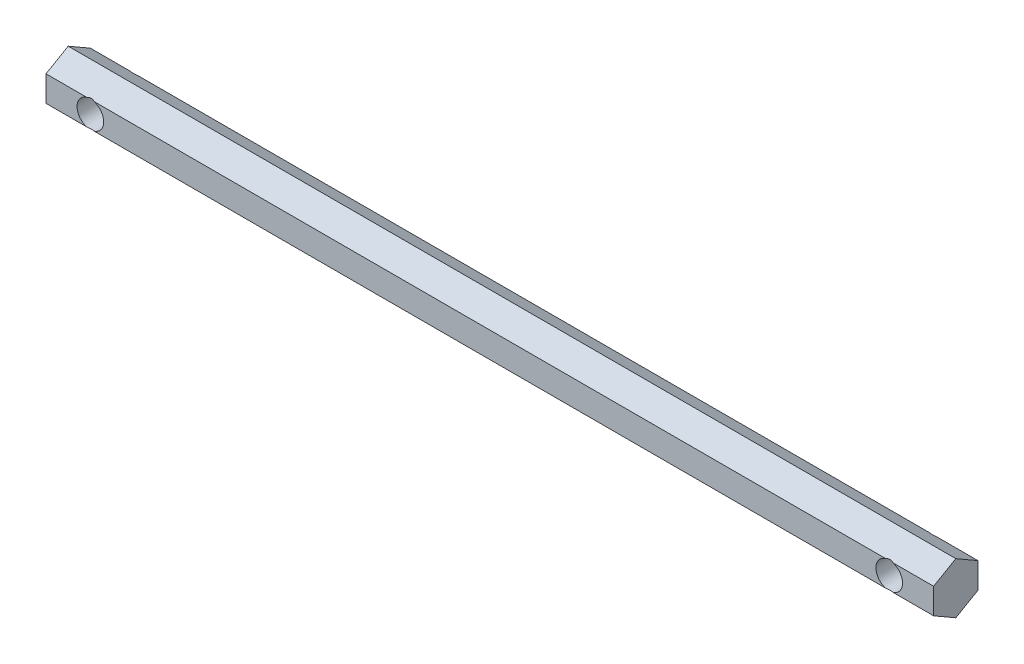
ISO-10303-21;
HEADER;
FILE_DESCRIPTION(('STEP AP214'),'2;1');
FILE_NAME('part.step','',(''),(''),'','','');
FILE_SCHEMA(('AUTOMOTIVE_DESIGN { 1 0 10303 214 1 1 1 1 }'));
ENDSEC;
DATA;
#1=APPLICATION_CONTEXT('core data for automotive mechanical design processes');
#2=APPLICATION_PROTOCOL_DEFINITION('international standard','automotive_design',2000,#1);
#3=PRODUCT_CONTEXT('',#1,'mechanical');
#4=PRODUCT('Part','Part','',(#3));
#5=PRODUCT_RELATED_PRODUCT_CATEGORY('part','',(#4));
#6=PRODUCT_DEFINITION_FORMATION('','',#4);
#7=PRODUCT_DEFINITION_CONTEXT('part definition',#1,'design');
#8=PRODUCT_DEFINITION('design','',#6,#7);
#9=PRODUCT_DEFINITION_SHAPE('','',#8);
#10=(LENGTH_UNIT() NAMED_UNIT(*) SI_UNIT(.MILLI.,.METRE.));
#11=(NAMED_UNIT(*) PLANE_ANGLE_UNIT() SI_UNIT($,.RADIAN.));
#12=(NAMED_UNIT(*) SI_UNIT($,.STERADIAN.) SOLID_ANGLE_UNIT());
#13=UNCERTAINTY_MEASURE_WITH_UNIT(LENGTH_MEASURE(1.E-05),#10,'distance_accuracy_value','');
#14=(GEOMETRIC_REPRESENTATION_CONTEXT(3) GLOBAL_UNCERTAINTY_ASSIGNED_CONTEXT((#13)) GLOBAL_UNIT_ASSIGNED_CONTEXT((#10,
#11,#12)) REPRESENTATION_CONTEXT('',''));
#15=CARTESIAN_POINT('',(0.,0.,0.));
#16=DIRECTION('',(0.,0.,1.));
#17=DIRECTION('',(1.,0.,0.));
#18=AXIS2_PLACEMENT_3D('',#15,#16,#17);
#19=CARTESIAN_POINT('',(100.,2.88675134594811,5.));
#20=DIRECTION('',(0.,0.,-1.));
#21=DIRECTION('',(0.,1.,0.));
#22=AXIS2_PLACEMENT_3D('',#19,#20,#21);
#23=PLANE('',#22);
#24=DIRECTION('',(-1.,0.,0.));
#25=VECTOR('',#24,1.);
#26=CARTESIAN_POINT('',(100.,2.88675134594811,5.));
#27=LINE('',#26,#25);
#28=CARTESIAN_POINT('',(100.,2.88675134594811,5.));
#29=VERTEX_POINT('',#28);
#30=CARTESIAN_POINT('',(90.8164965809278,2.88675134594811,5.));
#31=VERTEX_POINT('',#30);
#32=EDGE_CURVE('E182',#29,#31,#27,.T.);
#33=ORIENTED_EDGE('',*,*,#32,.T.);
#34=CARTESIAN_POINT('',(90.,0.,5.));
#35=DIRECTION('',(0.,0.,1.));
#36=DIRECTION('',(1.,0.,0.));
#37=AXIS2_PLACEMENT_3D('',#34,#35,#36);
#38=CIRCLE('',#37,3.00000000000001);
#39=CARTESIAN_POINT('',(90.8164965809277,-2.88675134594814,5.));
#40=VERTEX_POINT('',#39);
#41=EDGE_CURVE('E265',#40,#31,#38,.T.);
#42=ORIENTED_EDGE('',*,*,#41,.F.);
#43=DIRECTION('',(-1.,0.,0.));
#44=VECTOR('',#43,1.);
#45=CARTESIAN_POINT('',(100.,-2.88675134594815,4.99999999999998));
#46=LINE('',#45,#44);
#47=CARTESIAN_POINT('',(100.,-2.88675134594815,4.99999999999998));
#48=VERTEX_POINT('',#47);
#49=EDGE_CURVE('E177',#48,#40,#46,.T.);
#50=ORIENTED_EDGE('',*,*,#49,.F.);
#51=DIRECTION('',(0.,-1.,0.));
#52=VECTOR('',#51,1.);
#53=CARTESIAN_POINT('',(100.,2.88675134594811,5.));
#54=LINE('',#53,#52);
#55=EDGE_CURVE('E215',#29,#48,#54,.T.);
#56=ORIENTED_EDGE('',*,*,#55,.F.);
#57=EDGE_LOOP('',(#33,#42,#50,#56));
#58=FACE_BOUND('',#57,.T.);
#59=ADVANCED_FACE('F37',(#58),#23,.F.);
#60=CARTESIAN_POINT('',(89.1835034190723,-2.88675134594815,4.99999999999998));
#61=VERTEX_POINT('',#60);
#62=CARTESIAN_POINT('',(-89.1835034190722,-2.88675134594814,5.));
#63=VERTEX_POINT('',#62);
#64=EDGE_CURVE('E181',#61,#63,#46,.T.);
#65=ORIENTED_EDGE('',*,*,#64,.F.);
#66=CARTESIAN_POINT('',(89.1835034190722,2.88675134594811,5.));
#67=VERTEX_POINT('',#66);
#68=EDGE_CURVE('E60',#67,#61,#38,.T.);
#69=ORIENTED_EDGE('',*,*,#68,.F.);
#70=CARTESIAN_POINT('',(-89.1835034190723,2.88675134594811,5.));
#71=VERTEX_POINT('',#70);
#72=EDGE_CURVE('E186',#67,#71,#27,.T.);
#73=ORIENTED_EDGE('',*,*,#72,.T.);
#74=CARTESIAN_POINT('',(-90.,0.,5.));
#75=DIRECTION('',(0.,0.,1.));
#76=DIRECTION('',(1.,0.,0.));
#77=AXIS2_PLACEMENT_3D('',#74,#75,#76);
#78=CIRCLE('',#77,3.00000000000001);
#79=EDGE_CURVE('E272',#63,#71,#78,.T.);
#80=ORIENTED_EDGE('',*,*,#79,.F.);
#81=EDGE_LOOP('',(#65,#69,#73,#80));
#82=FACE_BOUND('',#81,.T.);
#83=ADVANCED_FACE('F271',(#82),#23,.F.);
#84=CARTESIAN_POINT('',(100.,-2.88675134594808,-5.00000000000002));
#85=DIRECTION('',(0.,0.,1.));
#86=DIRECTION('',(0.,-1.,0.));
#87=AXIS2_PLACEMENT_3D('',#84,#85,#86);
#88=PLANE('',#87);
#89=DIRECTION('',(-1.,0.,0.));
#90=VECTOR('',#89,1.);
#91=CARTESIAN_POINT('',(100.,-2.88675134594808,-5.00000000000002));
#92=LINE('',#91,#90);
#93=CARTESIAN_POINT('',(100.,-2.88675134594808,-5.00000000000002));
#94=VERTEX_POINT('',#93);
#95=CARTESIAN_POINT('',(90.8164965809279,-2.88675134594808,-5.00000000000002));
#96=VERTEX_POINT('',#95);
#97=EDGE_CURVE('E170',#94,#96,#92,.T.);
#98=ORIENTED_EDGE('',*,*,#97,.T.);
#99=CARTESIAN_POINT('',(90.,0.,-4.99999999999999));
#100=DIRECTION('',(0.,0.,1.));
#101=DIRECTION('',(0.,-1.,0.));
#102=AXIS2_PLACEMENT_3D('',#99,#100,#101);
#103=CIRCLE('',#102,3.00000000000001);
#104=CARTESIAN_POINT('',(90.8164965809275,2.88675134594818,-5.00000000000002));
#105=VERTEX_POINT('',#104);
#106=EDGE_CURVE('E11',#96,#105,#103,.T.);
#107=ORIENTED_EDGE('',*,*,#106,.T.);
#108=DIRECTION('',(-1.,0.,0.));
#109=VECTOR('',#108,1.);
#110=CARTESIAN_POINT('',(100.,2.88675134594818,-4.99999999999996));
#111=LINE('',#110,#109);
#112=CARTESIAN_POINT('',(100.,2.88675134594818,-4.99999999999996));
#113=VERTEX_POINT('',#112);
#114=EDGE_CURVE('E161',#113,#105,#111,.T.);
#115=ORIENTED_EDGE('',*,*,#114,.F.);
#116=DIRECTION('',(0.,1.,0.));
#117=VECTOR('',#116,1.);
#118=CARTESIAN_POINT('',(100.,-2.88675134594808,-5.00000000000002));
#119=LINE('',#118,#117);
#120=EDGE_CURVE('E165',#94,#113,#119,.T.);
#121=ORIENTED_EDGE('',*,*,#120,.F.);
#122=EDGE_LOOP('',(#98,#107,#115,#121));
#123=FACE_BOUND('',#122,.T.);
#124=ADVANCED_FACE('F249',(#123),#88,.F.);
#125=CARTESIAN_POINT('',(89.1835034190724,2.88675134594818,-5.00000000000002));
#126=VERTEX_POINT('',#125);
#127=CARTESIAN_POINT('',(-89.1835034190725,2.88675134594818,-5.00000000000002));
#128=VERTEX_POINT('',#127);
#129=EDGE_CURVE('E155',#126,#128,#111,.T.);
#130=ORIENTED_EDGE('',*,*,#129,.F.);
#131=CARTESIAN_POINT('',(89.1835034190721,-2.88675134594808,-5.00000000000002));
#132=VERTEX_POINT('',#131);
#133=EDGE_CURVE('E41',#126,#132,#103,.T.);
#134=ORIENTED_EDGE('',*,*,#133,.T.);
#135=CARTESIAN_POINT('',(-89.183503419072,-2.88675134594808,-5.00000000000002));
#136=VERTEX_POINT('',#135);
#137=EDGE_CURVE('E157',#132,#136,#92,.T.);
#138=ORIENTED_EDGE('',*,*,#137,.T.);
#139=CARTESIAN_POINT('',(-90.,0.,-4.99999999999999));
#140=DIRECTION('',(0.,0.,1.));
#141=DIRECTION('',(0.,-1.,0.));
#142=AXIS2_PLACEMENT_3D('',#139,#140,#141);
#143=CIRCLE('',#142,3.00000000000001);
#144=EDGE_CURVE('E140',#136,#128,#143,.T.);
#145=ORIENTED_EDGE('',*,*,#144,.T.);
#146=EDGE_LOOP('',(#130,#134,#138,#145));
#147=FACE_BOUND('',#146,.T.);
#148=ADVANCED_FACE('F153',(#147),#88,.F.);
#149=CARTESIAN_POINT('',(100.,2.88675134594818,-4.99999999999996));
#150=DIRECTION('',(0.,-0.866025403784442,0.499999999999995));
#151=DIRECTION('',(0.,-0.499999999999995,-0.866025403784442));
#152=AXIS2_PLACEMENT_3D('',#149,#150,#151);
#153=PLANE('',#152);
#154=ORIENTED_EDGE('',*,*,#114,.T.);
#155=CARTESIAN_POINT('',(90.,0.,-10.0000000000001));
#156=DIRECTION('',(0.,-0.866025403784442,0.499999999999995));
#157=DIRECTION('',(0.,0.499999999999995,0.866025403784442));
#158=AXIS2_PLACEMENT_3D('',#155,#156,#157);
#159=ELLIPSE('',#158,6.00000000000008,3.00000000000001);
#160=EDGE_CURVE('E160',#105,#126,#159,.T.);
#161=ORIENTED_EDGE('',*,*,#160,.T.);
#162=ORIENTED_EDGE('',*,*,#129,.T.);
#163=CARTESIAN_POINT('',(-90.,0.,-10.0000000000002));
#164=DIRECTION('',(0.,-0.866025403784442,0.499999999999995));
#165=DIRECTION('',(0.,0.499999999999995,0.866025403784442));
#166=AXIS2_PLACEMENT_3D('',#163,#164,#165);
#167=ELLIPSE('',#166,6.00000000000008,3.00000000000001);
#168=CARTESIAN_POINT('',(-90.8164965809274,2.88675134594818,-5.00000000000002));
#169=VERTEX_POINT('',#168);
#170=EDGE_CURVE('E137',#128,#169,#167,.T.);
#171=ORIENTED_EDGE('',*,*,#170,.T.);
#172=CARTESIAN_POINT('',(-100.,2.88675134594818,-4.99999999999996));
#173=VERTEX_POINT('',#172);
#174=EDGE_CURVE('E162',#169,#173,#111,.T.);
#175=ORIENTED_EDGE('',*,*,#174,.T.);
#176=DIRECTION('',(0.,0.499999999999995,0.866025403784441));
#177=VECTOR('',#176,1.);
#178=CARTESIAN_POINT('',(-100.,2.88675134594818,-4.99999999999996));
#179=LINE('',#178,#177);
#180=CARTESIAN_POINT('',(-100.,5.77350269189625,0.));
#181=VERTEX_POINT('',#180);
#182=EDGE_CURVE('E207',#173,#181,#179,.T.);
#183=ORIENTED_EDGE('',*,*,#182,.T.);
#184=DIRECTION('',(-1.,0.,0.));
#185=VECTOR('',#184,1.);
#186=CARTESIAN_POINT('',(100.,5.77350269189625,0.));
#187=LINE('',#186,#185);
#188=CARTESIAN_POINT('',(100.,5.77350269189625,0.));
#189=VERTEX_POINT('',#188);
#190=EDGE_CURVE('E185',#189,#181,#187,.T.);
#191=ORIENTED_EDGE('',*,*,#190,.F.);
#192=DIRECTION('',(0.,0.499999999999995,0.866025403784441));
#193=VECTOR('',#192,1.);
#194=CARTESIAN_POINT('',(100.,2.88675134594818,-4.99999999999996));
#195=LINE('',#194,#193);
#196=EDGE_CURVE('E208',#113,#189,#195,.T.);
#197=ORIENTED_EDGE('',*,*,#196,.F.);
#198=EDGE_LOOP('',(#154,#161,#162,#171,#175,#183,#191,#197));
#199=FACE_BOUND('',#198,.T.);
#200=ADVANCED_FACE('F39',(#199),#153,.F.);
#201=CARTESIAN_POINT('',(100.,5.77350269189625,0.));
#202=DIRECTION('',(0.,-0.866025403784438,-0.500000000000001));
#203=DIRECTION('',(0.,0.500000000000001,-0.866025403784438));
#204=AXIS2_PLACEMENT_3D('',#201,#202,#203);
#205=PLANE('',#204);
#206=ORIENTED_EDGE('',*,*,#72,.F.);
#207=CARTESIAN_POINT('',(90.,0.,9.99999999999997));
#208=DIRECTION('',(0.,-0.866025403784438,-0.500000000000001));
#209=DIRECTION('',(0.,-0.500000000000001,0.866025403784438));
#210=AXIS2_PLACEMENT_3D('',#207,#208,#209);
#211=ELLIPSE('',#210,6.,3.00000000000001);
#212=EDGE_CURVE('E256',#67,#31,#211,.T.);
#213=ORIENTED_EDGE('',*,*,#212,.T.);
#214=ORIENTED_EDGE('',*,*,#32,.F.);
#215=DIRECTION('',(0.,-0.500000000000001,0.866025403784438));
#216=VECTOR('',#215,1.);
#217=CARTESIAN_POINT('',(100.,5.77350269189625,0.));
#218=LINE('',#217,#216);
#219=EDGE_CURVE('E210',#189,#29,#218,.T.);
#220=ORIENTED_EDGE('',*,*,#219,.F.);
#221=ORIENTED_EDGE('',*,*,#190,.T.);
#222=DIRECTION('',(0.,-0.500000000000001,0.866025403784438));
#223=VECTOR('',#222,1.);
#224=CARTESIAN_POINT('',(-100.,5.77350269189625,0.));
#225=LINE('',#224,#223);
#226=CARTESIAN_POINT('',(-100.,2.88675134594811,5.));
#227=VERTEX_POINT('',#226);
#228=EDGE_CURVE('E227',#181,#227,#225,.T.);
#229=ORIENTED_EDGE('',*,*,#228,.T.);
#230=CARTESIAN_POINT('',(-90.8164965809277,2.88675134594811,5.));
#231=VERTEX_POINT('',#230);
#232=EDGE_CURVE('E180',#231,#227,#27,.T.);
#233=ORIENTED_EDGE('',*,*,#232,.F.);
#234=CARTESIAN_POINT('',(-90.,0.,10.));
#235=DIRECTION('',(0.,-0.866025403784438,-0.500000000000001));
#236=DIRECTION('',(0.,-0.500000000000001,0.866025403784438));
#237=AXIS2_PLACEMENT_3D('',#234,#235,#236);
#238=ELLIPSE('',#237,6.,3.00000000000001);
#239=EDGE_CURVE('E148',#231,#71,#238,.T.);
#240=ORIENTED_EDGE('',*,*,#239,.T.);
#241=EDGE_LOOP('',(#206,#213,#214,#220,#221,#229,#233,#240));
#242=FACE_BOUND('',#241,.T.);
#243=ADVANCED_FACE('F244',(#242),#205,.F.);
#244=CARTESIAN_POINT('',(-90.8164965809278,-2.88675134594815,4.99999999999998));
#245=VERTEX_POINT('',#244);
#246=CARTESIAN_POINT('',(-100.,-2.88675134594815,4.99999999999998));
#247=VERTEX_POINT('',#246);
#248=EDGE_CURVE('E176',#245,#247,#46,.T.);
#249=ORIENTED_EDGE('',*,*,#248,.F.);
#250=EDGE_CURVE('E52',#231,#245,#78,.T.);
#251=ORIENTED_EDGE('',*,*,#250,.F.);
#252=ORIENTED_EDGE('',*,*,#232,.T.);
#253=DIRECTION('',(0.,-1.,0.));
#254=VECTOR('',#253,1.);
#255=CARTESIAN_POINT('',(-100.,2.88675134594811,5.));
#256=LINE('',#255,#254);
#257=EDGE_CURVE('E230',#227,#247,#256,.T.);
#258=ORIENTED_EDGE('',*,*,#257,.T.);
#259=EDGE_LOOP('',(#249,#251,#252,#258));
#260=FACE_BOUND('',#259,.T.);
#261=ADVANCED_FACE('F239',(#260),#23,.F.);
#262=CARTESIAN_POINT('',(100.,-2.88675134594815,4.99999999999998));
#263=DIRECTION('',(0.,0.866025403784442,-0.499999999999995));
#264=DIRECTION('',(0.,0.499999999999995,0.866025403784442));
#265=AXIS2_PLACEMENT_3D('',#262,#263,#264);
#266=PLANE('',#265);
#267=ORIENTED_EDGE('',*,*,#49,.T.);
#268=CARTESIAN_POINT('',(90.,0.,10.0000000000001));
#269=DIRECTION('',(0.,0.866025403784442,-0.499999999999995));
#270=DIRECTION('',(0.,0.499999999999995,0.866025403784442));
#271=AXIS2_PLACEMENT_3D('',#268,#269,#270);
#272=ELLIPSE('',#271,6.00000000000007,3.00000000000001);
#273=EDGE_CURVE('E254',#40,#61,#272,.T.);
#274=ORIENTED_EDGE('',*,*,#273,.T.);
#275=ORIENTED_EDGE('',*,*,#64,.T.);
#276=CARTESIAN_POINT('',(-90.,0.,10.));
#277=DIRECTION('',(0.,0.866025403784442,-0.499999999999995));
#278=DIRECTION('',(0.,0.499999999999995,0.866025403784442));
#279=AXIS2_PLACEMENT_3D('',#276,#277,#278);
#280=ELLIPSE('',#279,6.00000000000007,3.00000000000001);
#281=EDGE_CURVE('E277',#63,#245,#280,.T.);
#282=ORIENTED_EDGE('',*,*,#281,.T.);
#283=ORIENTED_EDGE('',*,*,#248,.T.);
#284=DIRECTION('',(0.,-0.499999999999995,-0.866025403784441));
#285=VECTOR('',#284,1.);
#286=CARTESIAN_POINT('',(-100.,-2.88675134594815,4.99999999999998));
#287=LINE('',#286,#285);
#288=CARTESIAN_POINT('',(-100.,-5.77350269189625,0.));
#289=VERTEX_POINT('',#288);
#290=EDGE_CURVE('E203',#247,#289,#287,.T.);
#291=ORIENTED_EDGE('',*,*,#290,.T.);
#292=DIRECTION('',(-1.,0.,0.));
#293=VECTOR('',#292,1.);
#294=CARTESIAN_POINT('',(100.,-5.77350269189625,0.));
#295=LINE('',#294,#293);
#296=CARTESIAN_POINT('',(100.,-5.77350269189625,0.));
#297=VERTEX_POINT('',#296);
#298=EDGE_CURVE('E173',#297,#289,#295,.T.);
#299=ORIENTED_EDGE('',*,*,#298,.F.);
#300=DIRECTION('',(0.,-0.499999999999995,-0.866025403784441));
#301=VECTOR('',#300,1.);
#302=CARTESIAN_POINT('',(100.,-2.88675134594815,4.99999999999998));
#303=LINE('',#302,#301);
#304=EDGE_CURVE('E221',#48,#297,#303,.T.);
#305=ORIENTED_EDGE('',*,*,#304,.F.);
#306=EDGE_LOOP('',(#267,#274,#275,#282,#283,#291,#299,#305));
#307=FACE_BOUND('',#306,.T.);
#308=ADVANCED_FACE('F234',(#307),#266,.F.);
#309=CARTESIAN_POINT('',(100.,-5.77350269189625,0.));
#310=DIRECTION('',(0.,0.866025403784435,0.500000000000007));
#311=DIRECTION('',(0.,-0.500000000000007,0.866025403784435));
#312=AXIS2_PLACEMENT_3D('',#309,#310,#311);
#313=PLANE('',#312);
#314=ORIENTED_EDGE('',*,*,#137,.F.);
#315=CARTESIAN_POINT('',(90.,0.,-9.99999999999983));
#316=DIRECTION('',(0.,0.866025403784435,0.500000000000007));
#317=DIRECTION('',(0.,-0.500000000000007,0.866025403784435));
#318=AXIS2_PLACEMENT_3D('',#315,#316,#317);
#319=ELLIPSE('',#318,5.99999999999993,3.00000000000001);
#320=EDGE_CURVE('E147',#132,#96,#319,.T.);
#321=ORIENTED_EDGE('',*,*,#320,.T.);
#322=ORIENTED_EDGE('',*,*,#97,.F.);
#323=DIRECTION('',(0.,0.500000000000007,-0.866025403784435));
#324=VECTOR('',#323,1.);
#325=CARTESIAN_POINT('',(100.,-5.77350269189625,0.));
#326=LINE('',#325,#324);
#327=EDGE_CURVE('E223',#297,#94,#326,.T.);
#328=ORIENTED_EDGE('',*,*,#327,.F.);
#329=ORIENTED_EDGE('',*,*,#298,.T.);
#330=DIRECTION('',(0.,0.500000000000007,-0.866025403784435));
#331=VECTOR('',#330,1.);
#332=CARTESIAN_POINT('',(-100.,-5.77350269189625,0.));
#333=LINE('',#332,#331);
#334=CARTESIAN_POINT('',(-100.,-2.88675134594808,-5.00000000000002));
#335=VERTEX_POINT('',#334);
#336=EDGE_CURVE('E197',#289,#335,#333,.T.);
#337=ORIENTED_EDGE('',*,*,#336,.T.);
#338=CARTESIAN_POINT('',(-90.816496580928,-2.88675134594808,-5.00000000000002));
#339=VERTEX_POINT('',#338);
#340=EDGE_CURVE('E164',#339,#335,#92,.T.);
#341=ORIENTED_EDGE('',*,*,#340,.F.);
#342=CARTESIAN_POINT('',(-90.,0.,-9.99999999999979));
#343=DIRECTION('',(0.,0.866025403784435,0.500000000000007));
#344=DIRECTION('',(0.,-0.500000000000007,0.866025403784435));
#345=AXIS2_PLACEMENT_3D('',#342,#343,#344);
#346=ELLIPSE('',#345,5.99999999999993,3.00000000000001);
#347=EDGE_CURVE('E195',#339,#136,#346,.T.);
#348=ORIENTED_EDGE('',*,*,#347,.T.);
#349=EDGE_LOOP('',(#314,#321,#322,#328,#329,#337,#341,#348));
#350=FACE_BOUND('',#349,.T.);
#351=ADVANCED_FACE('F194',(#350),#313,.F.);
#352=ORIENTED_EDGE('',*,*,#174,.F.);
#353=EDGE_CURVE('E143',#169,#339,#143,.T.);
#354=ORIENTED_EDGE('',*,*,#353,.T.);
#355=ORIENTED_EDGE('',*,*,#340,.T.);
#356=DIRECTION('',(0.,1.,0.));
#357=VECTOR('',#356,1.);
#358=CARTESIAN_POINT('',(-100.,-2.88675134594808,-5.00000000000002));
#359=LINE('',#358,#357);
#360=EDGE_CURVE('E168',#335,#173,#359,.T.);
#361=ORIENTED_EDGE('',*,*,#360,.T.);
#362=EDGE_LOOP('',(#352,#354,#355,#361));
#363=FACE_BOUND('',#362,.T.);
#364=ADVANCED_FACE('F190',(#363),#88,.F.);
#365=CARTESIAN_POINT('',(100.,0.,0.));
#366=DIRECTION('',(1.,0.,0.));
#367=DIRECTION('',(0.,0.,-1.));
#368=AXIS2_PLACEMENT_3D('',#365,#366,#367);
#369=PLANE('',#368);
#370=ORIENTED_EDGE('',*,*,#196,.T.);
#371=ORIENTED_EDGE('',*,*,#219,.T.);
#372=ORIENTED_EDGE('',*,*,#55,.T.);
#373=ORIENTED_EDGE('',*,*,#304,.T.);
#374=ORIENTED_EDGE('',*,*,#327,.T.);
#375=ORIENTED_EDGE('',*,*,#120,.T.);
#376=EDGE_LOOP('',(#370,#371,#372,#373,#374,#375));
#377=FACE_BOUND('',#376,.T.);
#378=ADVANCED_FACE('F266',(#377),#369,.T.);
#379=CARTESIAN_POINT('',(-100.,0.,0.));
#380=DIRECTION('',(1.,0.,0.));
#381=DIRECTION('',(0.,0.,-1.));
#382=AXIS2_PLACEMENT_3D('',#379,#380,#381);
#383=PLANE('',#382);
#384=ORIENTED_EDGE('',*,*,#182,.F.);
#385=ORIENTED_EDGE('',*,*,#360,.F.);
#386=ORIENTED_EDGE('',*,*,#336,.F.);
#387=ORIENTED_EDGE('',*,*,#290,.F.);
#388=ORIENTED_EDGE('',*,*,#257,.F.);
#389=ORIENTED_EDGE('',*,*,#228,.F.);
#390=EDGE_LOOP('',(#384,#385,#386,#387,#388,#389));
#391=FACE_BOUND('',#390,.T.);
#392=ADVANCED_FACE('F205',(#391),#383,.F.);
#393=CARTESIAN_POINT('',(-90.,0.,-5.00000000000002));
#394=DIRECTION('',(0.,0.,1.));
#395=DIRECTION('',(1.,0.,0.));
#396=AXIS2_PLACEMENT_3D('',#393,#394,#395);
#397=CYLINDRICAL_SURFACE('',#396,3.00000000000001);
#398=ORIENTED_EDGE('',*,*,#250,.T.);
#399=ORIENTED_EDGE('',*,*,#281,.F.);
#400=ORIENTED_EDGE('',*,*,#79,.T.);
#401=ORIENTED_EDGE('',*,*,#239,.F.);
#402=EDGE_LOOP('',(#398,#399,#400,#401));
#403=FACE_BOUND('',#402,.T.);
#404=ORIENTED_EDGE('',*,*,#144,.F.);
#405=ORIENTED_EDGE('',*,*,#347,.F.);
#406=ORIENTED_EDGE('',*,*,#353,.F.);
#407=ORIENTED_EDGE('',*,*,#170,.F.);
#408=EDGE_LOOP('',(#404,#405,#406,#407));
#409=FACE_BOUND('',#408,.T.);
#410=ADVANCED_FACE('F139',(#403,#409),#397,.F.);
#411=CARTESIAN_POINT('',(90.,0.,-5.00000000000002));
#412=DIRECTION('',(0.,0.,1.));
#413=DIRECTION('',(1.,0.,0.));
#414=AXIS2_PLACEMENT_3D('',#411,#412,#413);
#415=CYLINDRICAL_SURFACE('',#414,3.00000000000001);
#416=ORIENTED_EDGE('',*,*,#68,.T.);
#417=ORIENTED_EDGE('',*,*,#273,.F.);
#418=ORIENTED_EDGE('',*,*,#41,.T.);
#419=ORIENTED_EDGE('',*,*,#212,.F.);
#420=EDGE_LOOP('',(#416,#417,#418,#419));
#421=FACE_BOUND('',#420,.T.);
#422=ORIENTED_EDGE('',*,*,#106,.F.);
#423=ORIENTED_EDGE('',*,*,#320,.F.);
#424=ORIENTED_EDGE('',*,*,#133,.F.);
#425=ORIENTED_EDGE('',*,*,#160,.F.);
#426=EDGE_LOOP('',(#422,#423,#424,#425));
#427=FACE_BOUND('',#426,.T.);
#428=ADVANCED_FACE('F253',(#421,#427),#415,.F.);
#429=CLOSED_SHELL('',(#59,#83,#124,#148,#200,#243,#261,#308,#351,#364,#378,#392,#410,#428));
#430=MANIFOLD_SOLID_BREP('B2',#429);
#431=ADVANCED_BREP_SHAPE_REPRESENTATION('',(#18,#430),#14);
#432=SHAPE_DEFINITION_REPRESENTATION(#9,#431);
ENDSEC;
END-ISO-10303-21;
